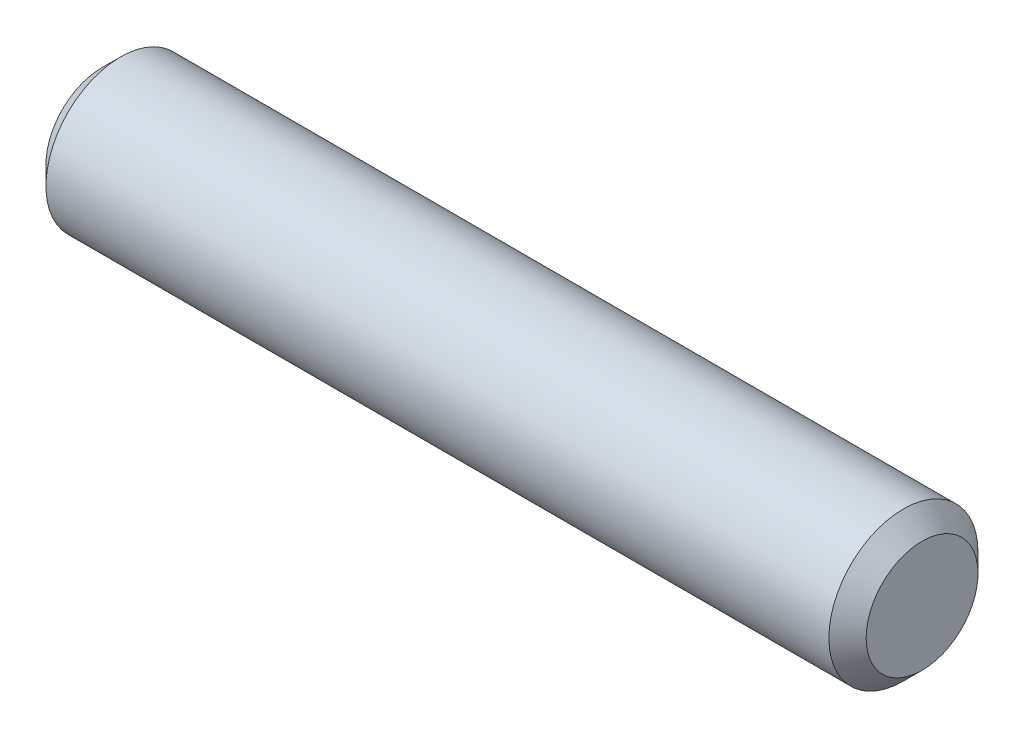
ISO-10303-21;
HEADER;
FILE_DESCRIPTION(('STEP AP214'),'2;1');
FILE_NAME('part.step','',(''),(''),'','','');
FILE_SCHEMA(('AUTOMOTIVE_DESIGN { 1 0 10303 214 1 1 1 1 }'));
ENDSEC;
DATA;
#1=APPLICATION_CONTEXT('core data for automotive mechanical design processes');
#2=APPLICATION_PROTOCOL_DEFINITION('international standard','automotive_design',2000,#1);
#3=PRODUCT_CONTEXT('',#1,'mechanical');
#4=PRODUCT('Part','Part','',(#3));
#5=PRODUCT_RELATED_PRODUCT_CATEGORY('part','',(#4));
#6=PRODUCT_DEFINITION_FORMATION('','',#4);
#7=PRODUCT_DEFINITION_CONTEXT('part definition',#1,'design');
#8=PRODUCT_DEFINITION('design','',#6,#7);
#9=PRODUCT_DEFINITION_SHAPE('','',#8);
#10=(LENGTH_UNIT() NAMED_UNIT(*) SI_UNIT(.MILLI.,.METRE.));
#11=(NAMED_UNIT(*) PLANE_ANGLE_UNIT() SI_UNIT($,.RADIAN.));
#12=(NAMED_UNIT(*) SI_UNIT($,.STERADIAN.) SOLID_ANGLE_UNIT());
#13=UNCERTAINTY_MEASURE_WITH_UNIT(LENGTH_MEASURE(1.E-05),#10,'distance_accuracy_value','');
#14=(GEOMETRIC_REPRESENTATION_CONTEXT(3) GLOBAL_UNCERTAINTY_ASSIGNED_CONTEXT((#13)) GLOBAL_UNIT_ASSIGNED_CONTEXT((#10,
#11,#12)) REPRESENTATION_CONTEXT('',''));
#15=CARTESIAN_POINT('',(0.,0.,0.));
#16=DIRECTION('',(0.,0.,1.));
#17=DIRECTION('',(1.,0.,0.));
#18=AXIS2_PLACEMENT_3D('',#15,#16,#17);
#19=CARTESIAN_POINT('',(0.,2.,0.));
#20=DIRECTION('',(1.,0.,0.));
#21=DIRECTION('',(0.,1.,0.));
#22=AXIS2_PLACEMENT_3D('',#19,#20,#21);
#23=PLANE('',#22);
#24=CARTESIAN_POINT('',(0.,2.,0.));
#25=DIRECTION('',(1.,0.,0.));
#26=DIRECTION('',(0.,1.,0.));
#27=AXIS2_PLACEMENT_3D('',#24,#25,#26);
#28=CIRCLE('',#27,1.49999999999999);
#29=CARTESIAN_POINT('',(0.,3.49999999999999,0.));
#30=VERTEX_POINT('',#29);
#31=EDGE_CURVE('E47',#30,#30,#28,.F.);
#32=ORIENTED_EDGE('',*,*,#31,.T.);
#33=EDGE_LOOP('',(#32));
#34=FACE_BOUND('',#33,.T.);
#35=ADVANCED_FACE('F39',(#34),#23,.F.);
#36=CARTESIAN_POINT('',(22.,2.,0.));
#37=DIRECTION('',(1.,0.,0.));
#38=DIRECTION('',(0.,1.,0.));
#39=AXIS2_PLACEMENT_3D('',#36,#37,#38);
#40=CYLINDRICAL_SURFACE('',#39,2.);
#41=CARTESIAN_POINT('',(0.500000000000007,2.,0.));
#42=DIRECTION('',(1.,0.,0.));
#43=DIRECTION('',(0.,0.,-1.));
#44=AXIS2_PLACEMENT_3D('',#41,#42,#43);
#45=CIRCLE('',#44,2.);
#46=CARTESIAN_POINT('',(0.500000000000007,2.,-2.));
#47=VERTEX_POINT('',#46);
#48=EDGE_CURVE('E51',#47,#47,#45,.T.);
#49=ORIENTED_EDGE('',*,*,#48,.T.);
#50=EDGE_LOOP('',(#49));
#51=FACE_BOUND('',#50,.T.);
#52=CARTESIAN_POINT('',(21.5,2.,0.));
#53=DIRECTION('',(-1.,0.,0.));
#54=DIRECTION('',(0.,0.,1.));
#55=AXIS2_PLACEMENT_3D('',#52,#53,#54);
#56=CIRCLE('',#55,2.);
#57=CARTESIAN_POINT('',(21.5,2.,2.));
#58=VERTEX_POINT('',#57);
#59=EDGE_CURVE('E55',#58,#58,#56,.T.);
#60=ORIENTED_EDGE('',*,*,#59,.T.);
#61=EDGE_LOOP('',(#60));
#62=FACE_BOUND('',#61,.T.);
#63=ADVANCED_FACE('F61',(#51,#62),#40,.T.);
#64=CARTESIAN_POINT('',(22.,0.,0.));
#65=DIRECTION('',(-1.,0.,0.));
#66=DIRECTION('',(0.,-1.,0.));
#67=AXIS2_PLACEMENT_3D('',#64,#65,#66);
#68=PLANE('',#67);
#69=CARTESIAN_POINT('',(22.,2.,0.));
#70=DIRECTION('',(-1.,0.,0.));
#71=DIRECTION('',(0.,-1.,0.));
#72=AXIS2_PLACEMENT_3D('',#69,#70,#71);
#73=CIRCLE('',#72,1.5);
#74=CARTESIAN_POINT('',(22.,0.499999999999999,0.));
#75=VERTEX_POINT('',#74);
#76=EDGE_CURVE('E10',#75,#75,#73,.F.);
#77=ORIENTED_EDGE('',*,*,#76,.T.);
#78=EDGE_LOOP('',(#77));
#79=FACE_BOUND('',#78,.T.);
#80=ADVANCED_FACE('F69',(#79),#68,.F.);
#81=CARTESIAN_POINT('',(0.500000000000007,2.,0.));
#82=DIRECTION('',(1.,0.,0.));
#83=DIRECTION('',(0.,0.,-1.));
#84=AXIS2_PLACEMENT_3D('',#81,#82,#83);
#85=CONICAL_SURFACE('',#84,2.,0.785398163397451);
#86=ORIENTED_EDGE('',*,*,#31,.F.);
#87=EDGE_LOOP('',(#86));
#88=FACE_BOUND('',#87,.T.);
#89=ORIENTED_EDGE('',*,*,#48,.F.);
#90=EDGE_LOOP('',(#89));
#91=FACE_BOUND('',#90,.T.);
#92=ADVANCED_FACE('F65',(#88,#91),#85,.T.);
#93=CARTESIAN_POINT('',(22.,2.,0.));
#94=DIRECTION('',(-1.,0.,0.));
#95=DIRECTION('',(0.,0.,1.));
#96=AXIS2_PLACEMENT_3D('',#93,#94,#95);
#97=CONICAL_SURFACE('',#96,1.5,0.785398163397449);
#98=ORIENTED_EDGE('',*,*,#59,.F.);
#99=EDGE_LOOP('',(#98));
#100=FACE_BOUND('',#99,.T.);
#101=ORIENTED_EDGE('',*,*,#76,.F.);
#102=EDGE_LOOP('',(#101));
#103=FACE_BOUND('',#102,.T.);
#104=ADVANCED_FACE('F42',(#100,#103),#97,.T.);
#105=CLOSED_SHELL('',(#35,#63,#80,#92,#104));
#106=MANIFOLD_SOLID_BREP('B2',#105);
#107=ADVANCED_BREP_SHAPE_REPRESENTATION('',(#18,#106),#14);
#108=SHAPE_DEFINITION_REPRESENTATION(#9,#107);
ENDSEC;
END-ISO-10303-21;
